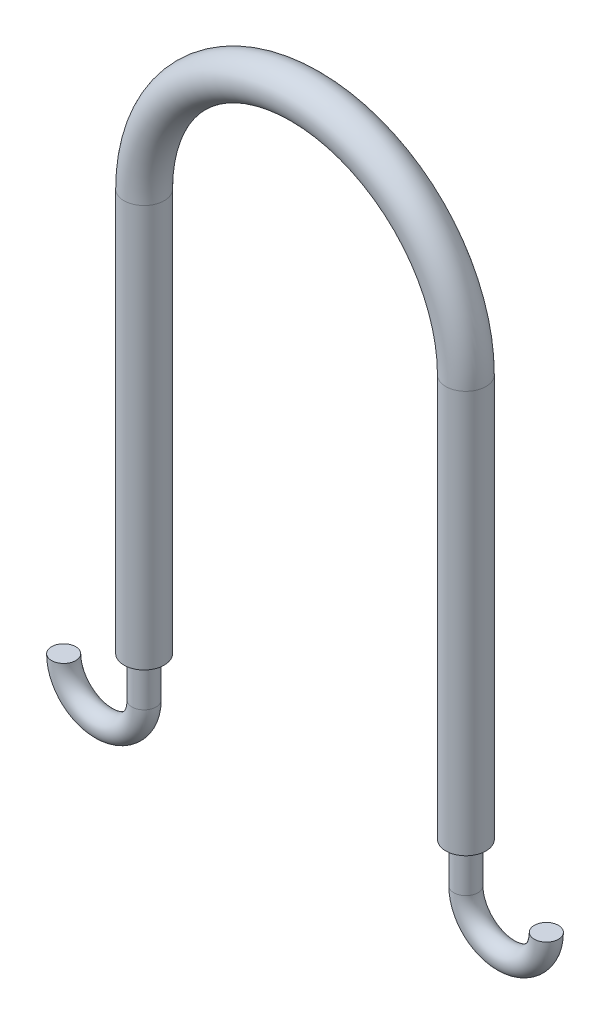
ISO-10303-21;
HEADER;
FILE_DESCRIPTION(('STEP AP214'),'2;1');
FILE_NAME('part.step','',(''),(''),'','','');
FILE_SCHEMA(('AUTOMOTIVE_DESIGN { 1 0 10303 214 1 1 1 1 }'));
ENDSEC;
DATA;
#1=APPLICATION_CONTEXT('core data for automotive mechanical design processes');
#2=APPLICATION_PROTOCOL_DEFINITION('international standard','automotive_design',2000,#1);
#3=PRODUCT_CONTEXT('',#1,'mechanical');
#4=PRODUCT('Part','Part','',(#3));
#5=PRODUCT_RELATED_PRODUCT_CATEGORY('part','',(#4));
#6=PRODUCT_DEFINITION_FORMATION('','',#4);
#7=PRODUCT_DEFINITION_CONTEXT('part definition',#1,'design');
#8=PRODUCT_DEFINITION('design','',#6,#7);
#9=PRODUCT_DEFINITION_SHAPE('','',#8);
#10=(LENGTH_UNIT() NAMED_UNIT(*) SI_UNIT(.MILLI.,.METRE.));
#11=(NAMED_UNIT(*) PLANE_ANGLE_UNIT() SI_UNIT($,.RADIAN.));
#12=(NAMED_UNIT(*) SI_UNIT($,.STERADIAN.) SOLID_ANGLE_UNIT());
#13=UNCERTAINTY_MEASURE_WITH_UNIT(LENGTH_MEASURE(1.E-05),#10,'distance_accuracy_value','');
#14=(GEOMETRIC_REPRESENTATION_CONTEXT(3) GLOBAL_UNCERTAINTY_ASSIGNED_CONTEXT((#13)) GLOBAL_UNIT_ASSIGNED_CONTEXT((#10,
#11,#12)) REPRESENTATION_CONTEXT('',''));
#15=CARTESIAN_POINT('',(0.,0.,0.));
#16=DIRECTION('',(0.,0.,1.));
#17=DIRECTION('',(1.,0.,0.));
#18=AXIS2_PLACEMENT_3D('',#15,#16,#17);
#19=CARTESIAN_POINT('',(-50.332854271467,-32.5230303411163,0.));
#20=DIRECTION('',(0.,-1.,0.));
#21=DIRECTION('',(0.,0.,1.));
#22=AXIS2_PLACEMENT_3D('',#19,#20,#21);
#23=PLANE('',#22);
#24=CARTESIAN_POINT('',(-50.332854271467,-32.5230303411163,0.));
#25=DIRECTION('',(0.,1.,0.));
#26=DIRECTION('',(0.,0.,-1.));
#27=AXIS2_PLACEMENT_3D('',#24,#25,#26);
#28=CIRCLE('',#27,3.80999999999999);
#29=CARTESIAN_POINT('',(-50.332854271467,-32.5230303411163,-3.80999999999999));
#30=VERTEX_POINT('',#29);
#31=EDGE_CURVE('E102',#30,#30,#28,.T.);
#32=ORIENTED_EDGE('',*,*,#31,.T.);
#33=EDGE_LOOP('',(#32));
#34=FACE_BOUND('',#33,.T.);
#35=CARTESIAN_POINT('',(-50.332854271467,-32.5230303411163,0.));
#36=DIRECTION('',(0.,-1.,0.));
#37=DIRECTION('',(0.,0.,1.));
#38=AXIS2_PLACEMENT_3D('',#35,#36,#37);
#39=CIRCLE('',#38,6.35);
#40=CARTESIAN_POINT('',(-50.332854271467,-32.5230303411163,6.35));
#41=VERTEX_POINT('',#40);
#42=EDGE_CURVE('E91',#41,#41,#39,.T.);
#43=ORIENTED_EDGE('',*,*,#42,.T.);
#44=EDGE_LOOP('',(#43));
#45=FACE_BOUND('',#44,.T.);
#46=ADVANCED_FACE('F77',(#34,#45),#23,.T.);
#47=CARTESIAN_POINT('',(51.267145728533,-32.5230303411163,0.));
#48=DIRECTION('',(0.,1.,0.));
#49=DIRECTION('',(0.,0.,1.));
#50=AXIS2_PLACEMENT_3D('',#47,#48,#49);
#51=PLANE('',#50);
#52=CARTESIAN_POINT('',(51.267145728533,-32.5230303411163,0.));
#53=DIRECTION('',(0.,1.,0.));
#54=DIRECTION('',(0.,0.,-1.));
#55=AXIS2_PLACEMENT_3D('',#52,#53,#54);
#56=CIRCLE('',#55,3.80999999999999);
#57=CARTESIAN_POINT('',(51.267145728533,-32.5230303411163,-3.80999999999999));
#58=VERTEX_POINT('',#57);
#59=EDGE_CURVE('E111',#58,#58,#56,.T.);
#60=ORIENTED_EDGE('',*,*,#59,.T.);
#61=EDGE_LOOP('',(#60));
#62=FACE_BOUND('',#61,.T.);
#63=CARTESIAN_POINT('',(51.267145728533,-32.5230303411163,0.));
#64=DIRECTION('',(0.,1.,0.));
#65=DIRECTION('',(0.,0.,1.));
#66=AXIS2_PLACEMENT_3D('',#63,#64,#65);
#67=CIRCLE('',#66,6.35);
#68=CARTESIAN_POINT('',(51.267145728533,-32.5230303411163,6.35));
#69=VERTEX_POINT('',#68);
#70=EDGE_CURVE('E11',#69,#69,#67,.T.);
#71=ORIENTED_EDGE('',*,*,#70,.F.);
#72=EDGE_LOOP('',(#71));
#73=FACE_BOUND('',#72,.T.);
#74=ADVANCED_FACE('F115',(#62,#73),#51,.F.);
#75=CARTESIAN_POINT('',(-50.332854271467,-32.5230303411163,0.));
#76=DIRECTION('',(0.,1.,0.));
#77=DIRECTION('',(0.,0.,1.));
#78=AXIS2_PLACEMENT_3D('',#75,#76,#77);
#79=CYLINDRICAL_SURFACE('',#78,6.35);
#80=CARTESIAN_POINT('',(-50.332854271467,94.4769696588837,0.));
#81=DIRECTION('',(0.,-1.,0.));
#82=DIRECTION('',(0.,0.,1.));
#83=AXIS2_PLACEMENT_3D('',#80,#81,#82);
#84=CIRCLE('',#83,6.35);
#85=CARTESIAN_POINT('',(-56.682854271467,94.4769696588837,0.));
#86=VERTEX_POINT('',#85);
#87=EDGE_CURVE('E87',#86,#86,#84,.T.);
#88=ORIENTED_EDGE('',*,*,#87,.T.);
#89=EDGE_LOOP('',(#88));
#90=FACE_BOUND('',#89,.T.);
#91=ORIENTED_EDGE('',*,*,#42,.F.);
#92=EDGE_LOOP('',(#91));
#93=FACE_BOUND('',#92,.T.);
#94=ADVANCED_FACE('F146',(#90,#93),#79,.T.);
#95=CARTESIAN_POINT('',(0.467145728533028,94.4769696588837,0.));
#96=DIRECTION('',(0.,0.,-1.));
#97=DIRECTION('',(-1.,0.,0.));
#98=AXIS2_PLACEMENT_3D('',#95,#96,#97);
#99=TOROIDAL_SURFACE('',#98,50.8,6.35);
#100=CARTESIAN_POINT('',(51.267145728533,94.4769696588837,0.));
#101=DIRECTION('',(0.,1.,0.));
#102=DIRECTION('',(0.,0.,1.));
#103=AXIS2_PLACEMENT_3D('',#100,#101,#102);
#104=CIRCLE('',#103,6.35);
#105=CARTESIAN_POINT('',(57.617145728533,94.4769696588837,0.));
#106=VERTEX_POINT('',#105);
#107=EDGE_CURVE('E83',#106,#106,#104,.T.);
#108=CARTESIAN_POINT('',(0.467145728533028,94.4769696588837,0.));
#109=DIRECTION('',(0.,0.,-1.));
#110=DIRECTION('',(-1.,0.,0.));
#111=AXIS2_PLACEMENT_3D('',#108,#109,#110);
#112=CIRCLE('',#111,57.15);
#113=EDGE_CURVE('',#86,#106,#112,.T.);
#114=ORIENTED_EDGE('',*,*,#87,.F.);
#115=ORIENTED_EDGE('',*,*,#107,.T.);
#116=ORIENTED_EDGE('',*,*,#113,.T.);
#117=ORIENTED_EDGE('',*,*,#113,.F.);
#118=EDGE_LOOP('',(#114,#116,#115,#117));
#119=FACE_BOUND('',#118,.T.);
#120=ADVANCED_FACE('F136',(#119),#99,.T.);
#121=CARTESIAN_POINT('',(51.267145728533,94.4769696588837,0.));
#122=DIRECTION('',(0.,-1.,0.));
#123=DIRECTION('',(0.,0.,-1.));
#124=AXIS2_PLACEMENT_3D('',#121,#122,#123);
#125=CYLINDRICAL_SURFACE('',#124,6.35);
#126=ORIENTED_EDGE('',*,*,#70,.T.);
#127=EDGE_LOOP('',(#126));
#128=FACE_BOUND('',#127,.T.);
#129=ORIENTED_EDGE('',*,*,#107,.F.);
#130=EDGE_LOOP('',(#129));
#131=FACE_BOUND('',#130,.T.);
#132=ADVANCED_FACE('F134',(#128,#131),#125,.T.);
#133=CARTESIAN_POINT('',(-75.732854271467,-45.2230303411163,0.));
#134=DIRECTION('',(0.,-1.,0.));
#135=DIRECTION('',(0.,0.,-1.));
#136=AXIS2_PLACEMENT_3D('',#133,#134,#135);
#137=PLANE('',#136);
#138=CARTESIAN_POINT('',(-75.732854271467,-45.2230303411163,0.));
#139=DIRECTION('',(0.,-1.,0.));
#140=DIRECTION('',(0.,0.,-1.));
#141=AXIS2_PLACEMENT_3D('',#138,#139,#140);
#142=CIRCLE('',#141,3.80999999999999);
#143=CARTESIAN_POINT('',(-79.542854271467,-45.2230303411163,0.));
#144=VERTEX_POINT('',#143);
#145=EDGE_CURVE('E96',#144,#144,#142,.T.);
#146=ORIENTED_EDGE('',*,*,#145,.F.);
#147=EDGE_LOOP('',(#146));
#148=FACE_BOUND('',#147,.T.);
#149=ADVANCED_FACE('F130',(#148),#137,.F.);
#150=CARTESIAN_POINT('',(-50.332854271467,-32.5230303411163,0.));
#151=DIRECTION('',(0.,-1.,0.));
#152=DIRECTION('',(0.,0.,-1.));
#153=AXIS2_PLACEMENT_3D('',#150,#151,#152);
#154=CYLINDRICAL_SURFACE('',#153,3.80999999999999);
#155=CARTESIAN_POINT('',(-50.332854271467,-45.2230303411163,0.));
#156=DIRECTION('',(0.,1.,0.));
#157=DIRECTION('',(0.,0.,-1.));
#158=AXIS2_PLACEMENT_3D('',#155,#156,#157);
#159=CIRCLE('',#158,3.80999999999999);
#160=CARTESIAN_POINT('',(-46.522854271467,-45.2230303411163,0.));
#161=VERTEX_POINT('',#160);
#162=EDGE_CURVE('E99',#161,#161,#159,.T.);
#163=ORIENTED_EDGE('',*,*,#162,.T.);
#164=EDGE_LOOP('',(#163));
#165=FACE_BOUND('',#164,.T.);
#166=ORIENTED_EDGE('',*,*,#31,.F.);
#167=EDGE_LOOP('',(#166));
#168=FACE_BOUND('',#167,.T.);
#169=ADVANCED_FACE('F143',(#165,#168),#154,.T.);
#170=CARTESIAN_POINT('',(-63.032854271467,-45.2230303411163,0.));
#171=DIRECTION('',(0.,0.,-1.));
#172=DIRECTION('',(-1.,0.,0.));
#173=AXIS2_PLACEMENT_3D('',#170,#171,#172);
#174=TOROIDAL_SURFACE('',#173,12.7,3.80999999999999);
#175=CARTESIAN_POINT('',(-63.032854271467,-45.2230303411163,0.));
#176=DIRECTION('',(0.,0.,-1.));
#177=DIRECTION('',(-1.,0.,0.));
#178=AXIS2_PLACEMENT_3D('',#175,#176,#177);
#179=CIRCLE('',#178,16.51);
#180=EDGE_CURVE('',#161,#144,#179,.T.);
#181=ORIENTED_EDGE('',*,*,#162,.F.);
#182=ORIENTED_EDGE('',*,*,#145,.T.);
#183=ORIENTED_EDGE('',*,*,#180,.T.);
#184=ORIENTED_EDGE('',*,*,#180,.F.);
#185=EDGE_LOOP('',(#181,#183,#182,#184));
#186=FACE_BOUND('',#185,.T.);
#187=ADVANCED_FACE('F131',(#186),#174,.T.);
#188=CARTESIAN_POINT('',(76.667145728533,-45.2230303411163,0.));
#189=DIRECTION('',(0.,-1.,0.));
#190=DIRECTION('',(0.,0.,-1.));
#191=AXIS2_PLACEMENT_3D('',#188,#189,#190);
#192=PLANE('',#191);
#193=CARTESIAN_POINT('',(76.667145728533,-45.2230303411163,0.));
#194=DIRECTION('',(0.,-1.,0.));
#195=DIRECTION('',(0.,0.,-1.));
#196=AXIS2_PLACEMENT_3D('',#193,#194,#195);
#197=CIRCLE('',#196,3.80999999999999);
#198=CARTESIAN_POINT('',(80.477145728533,-45.2230303411163,0.));
#199=VERTEX_POINT('',#198);
#200=EDGE_CURVE('E105',#199,#199,#197,.T.);
#201=ORIENTED_EDGE('',*,*,#200,.F.);
#202=EDGE_LOOP('',(#201));
#203=FACE_BOUND('',#202,.T.);
#204=ADVANCED_FACE('F121',(#203),#192,.F.);
#205=CARTESIAN_POINT('',(51.267145728533,-32.5230303411163,0.));
#206=DIRECTION('',(0.,-1.,0.));
#207=DIRECTION('',(1.,0.,0.));
#208=AXIS2_PLACEMENT_3D('',#205,#206,#207);
#209=CYLINDRICAL_SURFACE('',#208,3.80999999999999);
#210=CARTESIAN_POINT('',(51.267145728533,-45.2230303411163,0.));
#211=DIRECTION('',(0.,1.,0.));
#212=DIRECTION('',(0.,0.,-1.));
#213=AXIS2_PLACEMENT_3D('',#210,#211,#212);
#214=CIRCLE('',#213,3.80999999999999);
#215=CARTESIAN_POINT('',(47.457145728533,-45.2230303411163,0.));
#216=VERTEX_POINT('',#215);
#217=EDGE_CURVE('E108',#216,#216,#214,.T.);
#218=ORIENTED_EDGE('',*,*,#217,.T.);
#219=EDGE_LOOP('',(#218));
#220=FACE_BOUND('',#219,.T.);
#221=ORIENTED_EDGE('',*,*,#59,.F.);
#222=EDGE_LOOP('',(#221));
#223=FACE_BOUND('',#222,.T.);
#224=ADVANCED_FACE('F118',(#220,#223),#209,.T.);
#225=CARTESIAN_POINT('',(63.967145728533,-45.2230303411163,0.));
#226=DIRECTION('',(0.,0.,1.));
#227=DIRECTION('',(1.,0.,0.));
#228=AXIS2_PLACEMENT_3D('',#225,#226,#227);
#229=TOROIDAL_SURFACE('',#228,12.7,3.80999999999999);
#230=CARTESIAN_POINT('',(63.967145728533,-45.2230303411163,0.));
#231=DIRECTION('',(0.,0.,1.));
#232=DIRECTION('',(1.,0.,0.));
#233=AXIS2_PLACEMENT_3D('',#230,#231,#232);
#234=CIRCLE('',#233,16.51);
#235=EDGE_CURVE('',#216,#199,#234,.T.);
#236=ORIENTED_EDGE('',*,*,#217,.F.);
#237=ORIENTED_EDGE('',*,*,#200,.T.);
#238=ORIENTED_EDGE('',*,*,#235,.T.);
#239=ORIENTED_EDGE('',*,*,#235,.F.);
#240=EDGE_LOOP('',(#236,#238,#237,#239));
#241=FACE_BOUND('',#240,.T.);
#242=ADVANCED_FACE('F120',(#241),#229,.T.);
#243=CLOSED_SHELL('',(#46,#74,#94,#120,#132,#149,#169,#187,#204,#224,#242));
#244=MANIFOLD_SOLID_BREP('B2',#243);
#245=ADVANCED_BREP_SHAPE_REPRESENTATION('',(#18,#244),#14);
#246=SHAPE_DEFINITION_REPRESENTATION(#9,#245);
ENDSEC;
END-ISO-10303-21;
